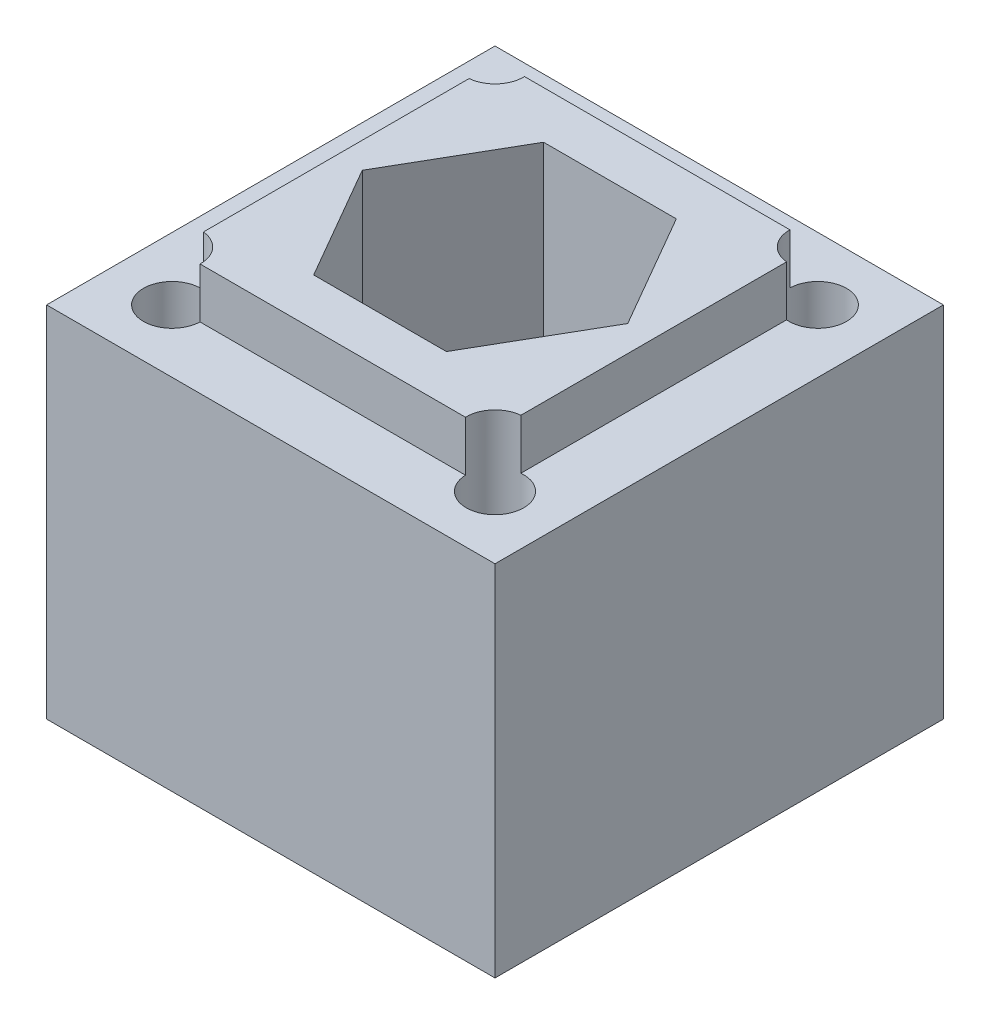
ISO-10303-21;
HEADER;
FILE_DESCRIPTION(('STEP AP214'),'2;1');
FILE_NAME('part.step','',(''),(''),'','','');
FILE_SCHEMA(('AUTOMOTIVE_DESIGN { 1 0 10303 214 1 1 1 1 }'));
ENDSEC;
DATA;
#1=APPLICATION_CONTEXT('core data for automotive mechanical design processes');
#2=APPLICATION_PROTOCOL_DEFINITION('international standard','automotive_design',2000,#1);
#3=PRODUCT_CONTEXT('',#1,'mechanical');
#4=PRODUCT('Part','Part','',(#3));
#5=PRODUCT_RELATED_PRODUCT_CATEGORY('part','',(#4));
#6=PRODUCT_DEFINITION_FORMATION('','',#4);
#7=PRODUCT_DEFINITION_CONTEXT('part definition',#1,'design');
#8=PRODUCT_DEFINITION('design','',#6,#7);
#9=PRODUCT_DEFINITION_SHAPE('','',#8);
#10=(LENGTH_UNIT() NAMED_UNIT(*) SI_UNIT(.MILLI.,.METRE.));
#11=(NAMED_UNIT(*) PLANE_ANGLE_UNIT() SI_UNIT($,.RADIAN.));
#12=(NAMED_UNIT(*) SI_UNIT($,.STERADIAN.) SOLID_ANGLE_UNIT());
#13=UNCERTAINTY_MEASURE_WITH_UNIT(LENGTH_MEASURE(1.E-05),#10,'distance_accuracy_value','');
#14=(GEOMETRIC_REPRESENTATION_CONTEXT(3) GLOBAL_UNCERTAINTY_ASSIGNED_CONTEXT((#13)) GLOBAL_UNIT_ASSIGNED_CONTEXT((#10,
#11,#12)) REPRESENTATION_CONTEXT('',''));
#15=CARTESIAN_POINT('',(0.,0.,0.));
#16=DIRECTION('',(0.,0.,1.));
#17=DIRECTION('',(1.,0.,0.));
#18=AXIS2_PLACEMENT_3D('',#15,#16,#17);
#19=CARTESIAN_POINT('',(0.,20.,0.));
#20=DIRECTION('',(0.,1.,0.));
#21=DIRECTION('',(0.,0.,1.));
#22=AXIS2_PLACEMENT_3D('',#19,#20,#21);
#23=PLANE('',#22);
#24=CARTESIAN_POINT('',(-9.,20.,9.));
#25=DIRECTION('',(0.,1.,0.));
#26=DIRECTION('',(0.,0.,1.));
#27=AXIS2_PLACEMENT_3D('',#24,#25,#26);
#28=CIRCLE('',#27,1.6);
#29=CARTESIAN_POINT('',(-8.84999999999999,20.,7.4070467677926));
#30=VERTEX_POINT('',#29);
#31=CARTESIAN_POINT('',(-7.40067118298047,20.,9.04633934668198));
#32=VERTEX_POINT('',#31);
#33=EDGE_CURVE('E50',#30,#32,#28,.T.);
#34=ORIENTED_EDGE('',*,*,#33,.F.);
#35=DIRECTION('',(0.,0.,1.));
#36=VECTOR('',#35,1.);
#37=CARTESIAN_POINT('',(-8.85,20.,-9.04633934668197));
#38=LINE('',#37,#36);
#39=CARTESIAN_POINT('',(-8.85,20.,-7.4070467677926));
#40=VERTEX_POINT('',#39);
#41=EDGE_CURVE('E193',#40,#30,#38,.T.);
#42=ORIENTED_EDGE('',*,*,#41,.F.);
#43=CARTESIAN_POINT('',(-9.,20.,-9.));
#44=DIRECTION('',(0.,1.,0.));
#45=DIRECTION('',(0.,0.,1.));
#46=AXIS2_PLACEMENT_3D('',#43,#44,#45);
#47=CIRCLE('',#46,1.6);
#48=CARTESIAN_POINT('',(-7.40067118298047,20.,-9.04633934668197));
#49=VERTEX_POINT('',#48);
#50=EDGE_CURVE('E282',#49,#40,#47,.T.);
#51=ORIENTED_EDGE('',*,*,#50,.F.);
#52=DIRECTION('',(-1.,0.,0.));
#53=VECTOR('',#52,1.);
#54=CARTESIAN_POINT('',(8.85,20.,-9.04633934668198));
#55=LINE('',#54,#53);
#56=CARTESIAN_POINT('',(7.40067118298047,20.,-9.04633934668198));
#57=VERTEX_POINT('',#56);
#58=EDGE_CURVE('E202',#57,#49,#55,.T.);
#59=ORIENTED_EDGE('',*,*,#58,.F.);
#60=CARTESIAN_POINT('',(9.,20.,-9.));
#61=DIRECTION('',(0.,1.,0.));
#62=DIRECTION('',(0.,0.,1.));
#63=AXIS2_PLACEMENT_3D('',#60,#61,#62);
#64=CIRCLE('',#63,1.6);
#65=CARTESIAN_POINT('',(8.85,20.,-7.4070467677926));
#66=VERTEX_POINT('',#65);
#67=EDGE_CURVE('E164',#66,#57,#64,.T.);
#68=ORIENTED_EDGE('',*,*,#67,.F.);
#69=DIRECTION('',(0.,0.,-1.));
#70=VECTOR('',#69,1.);
#71=CARTESIAN_POINT('',(8.85,20.,-9.04633934668198));
#72=LINE('',#71,#70);
#73=CARTESIAN_POINT('',(8.85,20.,7.40704676779259));
#74=VERTEX_POINT('',#73);
#75=EDGE_CURVE('E199',#74,#66,#72,.T.);
#76=ORIENTED_EDGE('',*,*,#75,.F.);
#77=CARTESIAN_POINT('',(9.,20.,9.));
#78=DIRECTION('',(0.,1.,0.));
#79=DIRECTION('',(0.,0.,1.));
#80=AXIS2_PLACEMENT_3D('',#77,#78,#79);
#81=CIRCLE('',#80,1.6);
#82=CARTESIAN_POINT('',(7.40067118298047,20.,9.04633934668198));
#83=VERTEX_POINT('',#82);
#84=EDGE_CURVE('E277',#83,#74,#81,.T.);
#85=ORIENTED_EDGE('',*,*,#84,.F.);
#86=DIRECTION('',(1.,0.,0.));
#87=VECTOR('',#86,1.);
#88=CARTESIAN_POINT('',(8.85,20.,9.04633934668198));
#89=LINE('',#88,#87);
#90=EDGE_CURVE('E196',#32,#83,#89,.T.);
#91=ORIENTED_EDGE('',*,*,#90,.F.);
#92=EDGE_LOOP('',(#34,#42,#51,#59,#68,#76,#85,#91));
#93=FACE_BOUND('',#92,.T.);
#94=DIRECTION('',(0.,0.,1.));
#95=VECTOR('',#94,1.);
#96=CARTESIAN_POINT('',(-12.5,20.,12.5));
#97=LINE('',#96,#95);
#98=CARTESIAN_POINT('',(-12.5,20.,-12.5));
#99=VERTEX_POINT('',#98);
#100=CARTESIAN_POINT('',(-12.5,20.,12.5));
#101=VERTEX_POINT('',#100);
#102=EDGE_CURVE('E236',#99,#101,#97,.T.);
#103=ORIENTED_EDGE('',*,*,#102,.T.);
#104=DIRECTION('',(1.,0.,0.));
#105=VECTOR('',#104,1.);
#106=CARTESIAN_POINT('',(12.5,20.,12.5));
#107=LINE('',#106,#105);
#108=CARTESIAN_POINT('',(12.5,20.,12.5));
#109=VERTEX_POINT('',#108);
#110=EDGE_CURVE('E239',#101,#109,#107,.T.);
#111=ORIENTED_EDGE('',*,*,#110,.T.);
#112=DIRECTION('',(0.,0.,-1.));
#113=VECTOR('',#112,1.);
#114=CARTESIAN_POINT('',(12.5,20.,12.5));
#115=LINE('',#114,#113);
#116=CARTESIAN_POINT('',(12.5,20.,-12.5));
#117=VERTEX_POINT('',#116);
#118=EDGE_CURVE('E242',#109,#117,#115,.T.);
#119=ORIENTED_EDGE('',*,*,#118,.T.);
#120=DIRECTION('',(-1.,0.,0.));
#121=VECTOR('',#120,1.);
#122=CARTESIAN_POINT('',(12.5,20.,-12.5));
#123=LINE('',#122,#121);
#124=EDGE_CURVE('E244',#117,#99,#123,.T.);
#125=ORIENTED_EDGE('',*,*,#124,.T.);
#126=EDGE_LOOP('',(#103,#111,#119,#125));
#127=FACE_BOUND('',#126,.T.);
#128=ADVANCED_FACE('F35',(#93,#127),#23,.T.);
#129=CARTESIAN_POINT('',(0.,0.,0.));
#130=DIRECTION('',(0.,1.,0.));
#131=DIRECTION('',(0.,0.,1.));
#132=AXIS2_PLACEMENT_3D('',#129,#130,#131);
#133=CYLINDRICAL_SURFACE('',#132,4.15);
#134=CARTESIAN_POINT('',(0.,0.,0.));
#135=DIRECTION('',(0.,1.,0.));
#136=DIRECTION('',(0.,0.,1.));
#137=AXIS2_PLACEMENT_3D('',#134,#135,#136);
#138=CIRCLE('',#137,4.15);
#139=CARTESIAN_POINT('',(0.,0.,4.15));
#140=VERTEX_POINT('',#139);
#141=EDGE_CURVE('E232',#140,#140,#138,.T.);
#142=ORIENTED_EDGE('',*,*,#141,.F.);
#143=EDGE_LOOP('',(#142));
#144=FACE_BOUND('',#143,.T.);
#145=CARTESIAN_POINT('',(0.,13.,0.));
#146=DIRECTION('',(0.,1.,0.));
#147=DIRECTION('',(0.,0.,1.));
#148=AXIS2_PLACEMENT_3D('',#145,#146,#147);
#149=CIRCLE('',#148,4.15);
#150=CARTESIAN_POINT('',(0.,13.,4.15));
#151=VERTEX_POINT('',#150);
#152=EDGE_CURVE('E222',#151,#151,#149,.F.);
#153=ORIENTED_EDGE('',*,*,#152,.F.);
#154=EDGE_LOOP('',(#153));
#155=FACE_BOUND('',#154,.T.);
#156=ADVANCED_FACE('F351',(#144,#155),#133,.F.);
#157=CARTESIAN_POINT('',(-12.5,20.,12.5));
#158=DIRECTION('',(1.,0.,0.));
#159=DIRECTION('',(0.,0.,-1.));
#160=AXIS2_PLACEMENT_3D('',#157,#158,#159);
#161=PLANE('',#160);
#162=DIRECTION('',(0.,0.,1.));
#163=VECTOR('',#162,1.);
#164=CARTESIAN_POINT('',(-12.5,0.,12.5));
#165=LINE('',#164,#163);
#166=CARTESIAN_POINT('',(-12.5,0.,-12.5));
#167=VERTEX_POINT('',#166);
#168=CARTESIAN_POINT('',(-12.5,0.,12.5));
#169=VERTEX_POINT('',#168);
#170=EDGE_CURVE('E235',#167,#169,#165,.T.);
#171=ORIENTED_EDGE('',*,*,#170,.T.);
#172=DIRECTION('',(0.,-1.,0.));
#173=VECTOR('',#172,1.);
#174=CARTESIAN_POINT('',(-12.5,20.,12.5));
#175=LINE('',#174,#173);
#176=EDGE_CURVE('E262',#101,#169,#175,.T.);
#177=ORIENTED_EDGE('',*,*,#176,.F.);
#178=ORIENTED_EDGE('',*,*,#102,.F.);
#179=DIRECTION('',(0.,-1.,0.));
#180=VECTOR('',#179,1.);
#181=CARTESIAN_POINT('',(-12.5,20.,-12.5));
#182=LINE('',#181,#180);
#183=EDGE_CURVE('E246',#99,#167,#182,.T.);
#184=ORIENTED_EDGE('',*,*,#183,.T.);
#185=EDGE_LOOP('',(#171,#177,#178,#184));
#186=FACE_BOUND('',#185,.T.);
#187=ADVANCED_FACE('F37',(#186),#161,.F.);
#188=CARTESIAN_POINT('',(12.5,20.,12.5));
#189=DIRECTION('',(0.,0.,-1.));
#190=DIRECTION('',(-1.,0.,0.));
#191=AXIS2_PLACEMENT_3D('',#188,#189,#190);
#192=PLANE('',#191);
#193=DIRECTION('',(1.,0.,0.));
#194=VECTOR('',#193,1.);
#195=CARTESIAN_POINT('',(12.5,0.,12.5));
#196=LINE('',#195,#194);
#197=CARTESIAN_POINT('',(12.5,0.,12.5));
#198=VERTEX_POINT('',#197);
#199=EDGE_CURVE('E249',#169,#198,#196,.T.);
#200=ORIENTED_EDGE('',*,*,#199,.T.);
#201=DIRECTION('',(0.,-1.,0.));
#202=VECTOR('',#201,1.);
#203=CARTESIAN_POINT('',(12.5,20.,12.5));
#204=LINE('',#203,#202);
#205=EDGE_CURVE('E259',#109,#198,#204,.T.);
#206=ORIENTED_EDGE('',*,*,#205,.F.);
#207=ORIENTED_EDGE('',*,*,#110,.F.);
#208=ORIENTED_EDGE('',*,*,#176,.T.);
#209=EDGE_LOOP('',(#200,#206,#207,#208));
#210=FACE_BOUND('',#209,.T.);
#211=ADVANCED_FACE('F371',(#210),#192,.F.);
#212=CARTESIAN_POINT('',(12.5,20.,12.5));
#213=DIRECTION('',(-1.,0.,0.));
#214=DIRECTION('',(0.,0.,1.));
#215=AXIS2_PLACEMENT_3D('',#212,#213,#214);
#216=PLANE('',#215);
#217=DIRECTION('',(0.,0.,-1.));
#218=VECTOR('',#217,1.);
#219=CARTESIAN_POINT('',(12.5,0.,12.5));
#220=LINE('',#219,#218);
#221=CARTESIAN_POINT('',(12.5,0.,-12.5));
#222=VERTEX_POINT('',#221);
#223=EDGE_CURVE('E251',#198,#222,#220,.T.);
#224=ORIENTED_EDGE('',*,*,#223,.T.);
#225=DIRECTION('',(0.,-1.,0.));
#226=VECTOR('',#225,1.);
#227=CARTESIAN_POINT('',(12.5,20.,-12.5));
#228=LINE('',#227,#226);
#229=EDGE_CURVE('E256',#117,#222,#228,.T.);
#230=ORIENTED_EDGE('',*,*,#229,.F.);
#231=ORIENTED_EDGE('',*,*,#118,.F.);
#232=ORIENTED_EDGE('',*,*,#205,.T.);
#233=EDGE_LOOP('',(#224,#230,#231,#232));
#234=FACE_BOUND('',#233,.T.);
#235=ADVANCED_FACE('F368',(#234),#216,.F.);
#236=CARTESIAN_POINT('',(12.5,20.,-12.5));
#237=DIRECTION('',(0.,0.,1.));
#238=DIRECTION('',(1.,0.,0.));
#239=AXIS2_PLACEMENT_3D('',#236,#237,#238);
#240=PLANE('',#239);
#241=DIRECTION('',(-1.,0.,0.));
#242=VECTOR('',#241,1.);
#243=CARTESIAN_POINT('',(12.5,0.,-12.5));
#244=LINE('',#243,#242);
#245=EDGE_CURVE('E240',#222,#167,#244,.T.);
#246=ORIENTED_EDGE('',*,*,#245,.T.);
#247=ORIENTED_EDGE('',*,*,#183,.F.);
#248=ORIENTED_EDGE('',*,*,#124,.F.);
#249=ORIENTED_EDGE('',*,*,#229,.T.);
#250=EDGE_LOOP('',(#246,#247,#248,#249));
#251=FACE_BOUND('',#250,.T.);
#252=ADVANCED_FACE('F364',(#251),#240,.F.);
#253=CARTESIAN_POINT('',(0.,0.,0.));
#254=DIRECTION('',(0.,1.,0.));
#255=DIRECTION('',(0.,0.,1.));
#256=AXIS2_PLACEMENT_3D('',#253,#254,#255);
#257=PLANE('',#256);
#258=CARTESIAN_POINT('',(-9.,0.,9.));
#259=DIRECTION('',(0.,1.,0.));
#260=DIRECTION('',(0.,0.,1.));
#261=AXIS2_PLACEMENT_3D('',#258,#259,#260);
#262=CIRCLE('',#261,1.6);
#263=CARTESIAN_POINT('',(-9.,0.,10.6));
#264=VERTEX_POINT('',#263);
#265=EDGE_CURVE('E280',#264,#264,#262,.T.);
#266=ORIENTED_EDGE('',*,*,#265,.T.);
#267=EDGE_LOOP('',(#266));
#268=FACE_BOUND('',#267,.T.);
#269=CARTESIAN_POINT('',(-9.,0.,-9.));
#270=DIRECTION('',(0.,1.,0.));
#271=DIRECTION('',(0.,0.,1.));
#272=AXIS2_PLACEMENT_3D('',#269,#270,#271);
#273=CIRCLE('',#272,1.6);
#274=CARTESIAN_POINT('',(-9.,0.,-7.4));
#275=VERTEX_POINT('',#274);
#276=EDGE_CURVE('E334',#275,#275,#273,.T.);
#277=ORIENTED_EDGE('',*,*,#276,.T.);
#278=EDGE_LOOP('',(#277));
#279=FACE_BOUND('',#278,.T.);
#280=CARTESIAN_POINT('',(9.,0.,-9.));
#281=DIRECTION('',(0.,1.,0.));
#282=DIRECTION('',(0.,0.,1.));
#283=AXIS2_PLACEMENT_3D('',#280,#281,#282);
#284=CIRCLE('',#283,1.6);
#285=CARTESIAN_POINT('',(9.,0.,-7.4));
#286=VERTEX_POINT('',#285);
#287=EDGE_CURVE('E181',#286,#286,#284,.T.);
#288=ORIENTED_EDGE('',*,*,#287,.T.);
#289=EDGE_LOOP('',(#288));
#290=FACE_BOUND('',#289,.T.);
#291=CARTESIAN_POINT('',(9.,0.,9.));
#292=DIRECTION('',(0.,1.,0.));
#293=DIRECTION('',(0.,0.,1.));
#294=AXIS2_PLACEMENT_3D('',#291,#292,#293);
#295=CIRCLE('',#294,1.6);
#296=CARTESIAN_POINT('',(9.,0.,10.6));
#297=VERTEX_POINT('',#296);
#298=EDGE_CURVE('E299',#297,#297,#295,.T.);
#299=ORIENTED_EDGE('',*,*,#298,.T.);
#300=EDGE_LOOP('',(#299));
#301=FACE_BOUND('',#300,.T.);
#302=ORIENTED_EDGE('',*,*,#141,.T.);
#303=EDGE_LOOP('',(#302));
#304=FACE_BOUND('',#303,.T.);
#305=ORIENTED_EDGE('',*,*,#170,.F.);
#306=ORIENTED_EDGE('',*,*,#245,.F.);
#307=ORIENTED_EDGE('',*,*,#223,.F.);
#308=ORIENTED_EDGE('',*,*,#199,.F.);
#309=EDGE_LOOP('',(#305,#306,#307,#308));
#310=FACE_BOUND('',#309,.T.);
#311=ADVANCED_FACE('F360',(#268,#279,#290,#301,#304,#310),#257,.F.);
#312=CARTESIAN_POINT('',(0.,13.,0.));
#313=DIRECTION('',(0.,1.,0.));
#314=DIRECTION('',(0.,0.,1.));
#315=AXIS2_PLACEMENT_3D('',#312,#313,#314);
#316=PLANE('',#315);
#317=DIRECTION('',(0.5,0.,0.866025403784439));
#318=VECTOR('',#317,1.);
#319=CARTESIAN_POINT('',(-7.4,13.,0.));
#320=LINE('',#319,#318);
#321=CARTESIAN_POINT('',(-7.4,13.,0.));
#322=VERTEX_POINT('',#321);
#323=CARTESIAN_POINT('',(-3.7,13.,6.40858798800485));
#324=VERTEX_POINT('',#323);
#325=EDGE_CURVE('E184',#322,#324,#320,.T.);
#326=ORIENTED_EDGE('',*,*,#325,.T.);
#327=DIRECTION('',(1.,0.,0.));
#328=VECTOR('',#327,1.);
#329=CARTESIAN_POINT('',(-3.7,13.,6.40858798800485));
#330=LINE('',#329,#328);
#331=CARTESIAN_POINT('',(3.7,13.,6.40858798800485));
#332=VERTEX_POINT('',#331);
#333=EDGE_CURVE('E187',#324,#332,#330,.T.);
#334=ORIENTED_EDGE('',*,*,#333,.T.);
#335=DIRECTION('',(0.5,0.,-0.866025403784439));
#336=VECTOR('',#335,1.);
#337=CARTESIAN_POINT('',(3.7,13.,6.40858798800485));
#338=LINE('',#337,#336);
#339=CARTESIAN_POINT('',(7.4,13.,0.));
#340=VERTEX_POINT('',#339);
#341=EDGE_CURVE('E207',#332,#340,#338,.T.);
#342=ORIENTED_EDGE('',*,*,#341,.T.);
#343=DIRECTION('',(-0.5,0.,-0.866025403784439));
#344=VECTOR('',#343,1.);
#345=CARTESIAN_POINT('',(7.4,13.,0.));
#346=LINE('',#345,#344);
#347=CARTESIAN_POINT('',(3.7,13.,-6.40858798800485));
#348=VERTEX_POINT('',#347);
#349=EDGE_CURVE('E210',#340,#348,#346,.T.);
#350=ORIENTED_EDGE('',*,*,#349,.T.);
#351=DIRECTION('',(-1.,0.,0.));
#352=VECTOR('',#351,1.);
#353=CARTESIAN_POINT('',(3.7,13.,-6.40858798800485));
#354=LINE('',#353,#352);
#355=CARTESIAN_POINT('',(-3.7,13.,-6.40858798800484));
#356=VERTEX_POINT('',#355);
#357=EDGE_CURVE('E213',#348,#356,#354,.T.);
#358=ORIENTED_EDGE('',*,*,#357,.T.);
#359=DIRECTION('',(-0.5,0.,0.866025403784439));
#360=VECTOR('',#359,1.);
#361=CARTESIAN_POINT('',(-3.7,13.,-6.40858798800484));
#362=LINE('',#361,#360);
#363=EDGE_CURVE('E216',#356,#322,#362,.T.);
#364=ORIENTED_EDGE('',*,*,#363,.T.);
#365=EDGE_LOOP('',(#326,#334,#342,#350,#358,#364));
#366=FACE_BOUND('',#365,.T.);
#367=ORIENTED_EDGE('',*,*,#152,.T.);
#368=EDGE_LOOP('',(#367));
#369=FACE_BOUND('',#368,.T.);
#370=ADVANCED_FACE('F363',(#366,#369),#316,.T.);
#371=CARTESIAN_POINT('',(-7.4,13.,0.));
#372=DIRECTION('',(-0.866025403784438,0.,0.5));
#373=DIRECTION('',(0.5,0.,0.866025403784439));
#374=AXIS2_PLACEMENT_3D('',#371,#372,#373);
#375=PLANE('',#374);
#376=DIRECTION('',(0.,1.,0.));
#377=VECTOR('',#376,1.);
#378=CARTESIAN_POINT('',(-7.4,13.,0.));
#379=LINE('',#378,#377);
#380=CARTESIAN_POINT('',(-7.4,22.8,0.));
#381=VERTEX_POINT('',#380);
#382=EDGE_CURVE('E220',#322,#381,#379,.T.);
#383=ORIENTED_EDGE('',*,*,#382,.T.);
#384=DIRECTION('',(0.500000000000005,0.,0.866025403784436));
#385=VECTOR('',#384,1.);
#386=CARTESIAN_POINT('',(-7.4,22.8,0.));
#387=LINE('',#386,#385);
#388=CARTESIAN_POINT('',(-3.7,22.8,6.40858798800485));
#389=VERTEX_POINT('',#388);
#390=EDGE_CURVE('E306',#381,#389,#387,.T.);
#391=ORIENTED_EDGE('',*,*,#390,.T.);
#392=DIRECTION('',(0.,1.,0.));
#393=VECTOR('',#392,1.);
#394=CARTESIAN_POINT('',(-3.7,13.,6.40858798800485));
#395=LINE('',#394,#393);
#396=EDGE_CURVE('E219',#324,#389,#395,.T.);
#397=ORIENTED_EDGE('',*,*,#396,.F.);
#398=ORIENTED_EDGE('',*,*,#325,.F.);
#399=EDGE_LOOP('',(#383,#391,#397,#398));
#400=FACE_BOUND('',#399,.T.);
#401=ADVANCED_FACE('F410',(#400),#375,.F.);
#402=CARTESIAN_POINT('',(-3.7,13.,-6.40858798800484));
#403=DIRECTION('',(-0.866025403784439,0.,-0.5));
#404=DIRECTION('',(-0.5,0.,0.866025403784439));
#405=AXIS2_PLACEMENT_3D('',#402,#403,#404);
#406=PLANE('',#405);
#407=DIRECTION('',(0.,1.,0.));
#408=VECTOR('',#407,1.);
#409=CARTESIAN_POINT('',(-3.7,13.,-6.40858798800484));
#410=LINE('',#409,#408);
#411=CARTESIAN_POINT('',(-3.70000000000005,22.8,-6.4085879880048));
#412=VERTEX_POINT('',#411);
#413=EDGE_CURVE('E223',#356,#412,#410,.T.);
#414=ORIENTED_EDGE('',*,*,#413,.T.);
#415=DIRECTION('',(-0.499999999999991,0.,0.866025403784444));
#416=VECTOR('',#415,1.);
#417=CARTESIAN_POINT('',(-3.70000000000005,22.8,-6.4085879880048));
#418=LINE('',#417,#416);
#419=EDGE_CURVE('E197',#412,#381,#418,.T.);
#420=ORIENTED_EDGE('',*,*,#419,.T.);
#421=ORIENTED_EDGE('',*,*,#382,.F.);
#422=ORIENTED_EDGE('',*,*,#363,.F.);
#423=EDGE_LOOP('',(#414,#420,#421,#422));
#424=FACE_BOUND('',#423,.T.);
#425=ADVANCED_FACE('F421',(#424),#406,.F.);
#426=CARTESIAN_POINT('',(3.7,13.,-6.40858798800485));
#427=DIRECTION('',(0.,0.,-1.));
#428=DIRECTION('',(-1.,0.,0.));
#429=AXIS2_PLACEMENT_3D('',#426,#427,#428);
#430=PLANE('',#429);
#431=DIRECTION('',(0.,1.,0.));
#432=VECTOR('',#431,1.);
#433=CARTESIAN_POINT('',(3.7,13.,-6.40858798800485));
#434=LINE('',#433,#432);
#435=CARTESIAN_POINT('',(3.69999999999996,22.8,-6.40858798800486));
#436=VERTEX_POINT('',#435);
#437=EDGE_CURVE('E225',#348,#436,#434,.T.);
#438=ORIENTED_EDGE('',*,*,#437,.T.);
#439=DIRECTION('',(-1.,0.,0.));
#440=VECTOR('',#439,1.);
#441=CARTESIAN_POINT('',(3.69999999999996,22.8,-6.40858798800486));
#442=LINE('',#441,#440);
#443=EDGE_CURVE('E318',#436,#412,#442,.T.);
#444=ORIENTED_EDGE('',*,*,#443,.T.);
#445=ORIENTED_EDGE('',*,*,#413,.F.);
#446=ORIENTED_EDGE('',*,*,#357,.F.);
#447=EDGE_LOOP('',(#438,#444,#445,#446));
#448=FACE_BOUND('',#447,.T.);
#449=ADVANCED_FACE('F431',(#448),#430,.F.);
#450=CARTESIAN_POINT('',(7.4,13.,0.));
#451=DIRECTION('',(0.866025403784438,0.,-0.5));
#452=DIRECTION('',(-0.5,0.,-0.866025403784439));
#453=AXIS2_PLACEMENT_3D('',#450,#451,#452);
#454=PLANE('',#453);
#455=DIRECTION('',(0.,1.,0.));
#456=VECTOR('',#455,1.);
#457=CARTESIAN_POINT('',(7.4,13.,0.));
#458=LINE('',#457,#456);
#459=CARTESIAN_POINT('',(7.4,22.8,0.));
#460=VERTEX_POINT('',#459);
#461=EDGE_CURVE('E227',#340,#460,#458,.T.);
#462=ORIENTED_EDGE('',*,*,#461,.T.);
#463=DIRECTION('',(-0.500000000000005,0.,-0.866025403784436));
#464=VECTOR('',#463,1.);
#465=CARTESIAN_POINT('',(7.4,22.8,0.));
#466=LINE('',#465,#464);
#467=EDGE_CURVE('E315',#460,#436,#466,.T.);
#468=ORIENTED_EDGE('',*,*,#467,.T.);
#469=ORIENTED_EDGE('',*,*,#437,.F.);
#470=ORIENTED_EDGE('',*,*,#349,.F.);
#471=EDGE_LOOP('',(#462,#468,#469,#470));
#472=FACE_BOUND('',#471,.T.);
#473=ADVANCED_FACE('F442',(#472),#454,.F.);
#474=CARTESIAN_POINT('',(3.7,13.,6.40858798800485));
#475=DIRECTION('',(0.866025403784439,0.,0.5));
#476=DIRECTION('',(0.5,0.,-0.866025403784439));
#477=AXIS2_PLACEMENT_3D('',#474,#475,#476);
#478=PLANE('',#477);
#479=DIRECTION('',(0.,1.,0.));
#480=VECTOR('',#479,1.);
#481=CARTESIAN_POINT('',(3.7,13.,6.40858798800485));
#482=LINE('',#481,#480);
#483=CARTESIAN_POINT('',(3.70000000000001,22.8,6.40858798800484));
#484=VERTEX_POINT('',#483);
#485=EDGE_CURVE('E229',#332,#484,#482,.T.);
#486=ORIENTED_EDGE('',*,*,#485,.T.);
#487=DIRECTION('',(0.499999999999997,0.,-0.86602540378444));
#488=VECTOR('',#487,1.);
#489=CARTESIAN_POINT('',(3.70000000000001,22.8,6.40858798800484));
#490=LINE('',#489,#488);
#491=EDGE_CURVE('E312',#484,#460,#490,.T.);
#492=ORIENTED_EDGE('',*,*,#491,.T.);
#493=ORIENTED_EDGE('',*,*,#461,.F.);
#494=ORIENTED_EDGE('',*,*,#341,.F.);
#495=EDGE_LOOP('',(#486,#492,#493,#494));
#496=FACE_BOUND('',#495,.T.);
#497=ADVANCED_FACE('F453',(#496),#478,.F.);
#498=CARTESIAN_POINT('',(-3.7,13.,6.40858798800485));
#499=DIRECTION('',(0.,0.,1.));
#500=DIRECTION('',(1.,0.,0.));
#501=AXIS2_PLACEMENT_3D('',#498,#499,#500);
#502=PLANE('',#501);
#503=ORIENTED_EDGE('',*,*,#396,.T.);
#504=DIRECTION('',(1.,0.,0.));
#505=VECTOR('',#504,1.);
#506=CARTESIAN_POINT('',(-3.7,22.8,6.40858798800485));
#507=LINE('',#506,#505);
#508=EDGE_CURVE('E309',#389,#484,#507,.T.);
#509=ORIENTED_EDGE('',*,*,#508,.T.);
#510=ORIENTED_EDGE('',*,*,#485,.F.);
#511=ORIENTED_EDGE('',*,*,#333,.F.);
#512=EDGE_LOOP('',(#503,#509,#510,#511));
#513=FACE_BOUND('',#512,.T.);
#514=ADVANCED_FACE('F464',(#513),#502,.F.);
#515=CARTESIAN_POINT('',(0.,22.8,0.));
#516=DIRECTION('',(0.,-1.,0.));
#517=DIRECTION('',(0.,0.,-1.));
#518=AXIS2_PLACEMENT_3D('',#515,#516,#517);
#519=PLANE('',#518);
#520=DIRECTION('',(0.,0.,1.));
#521=VECTOR('',#520,1.);
#522=CARTESIAN_POINT('',(-8.85,22.8,-9.04633934668197));
#523=LINE('',#522,#521);
#524=CARTESIAN_POINT('',(-8.85,22.8,-7.4070467677926));
#525=VERTEX_POINT('',#524);
#526=CARTESIAN_POINT('',(-8.84999999999999,22.8,7.4070467677926));
#527=VERTEX_POINT('',#526);
#528=EDGE_CURVE('E203',#525,#527,#523,.T.);
#529=ORIENTED_EDGE('',*,*,#528,.T.);
#530=CARTESIAN_POINT('',(-9.,22.8,9.));
#531=DIRECTION('',(0.,1.,0.));
#532=DIRECTION('',(0.,0.,1.));
#533=AXIS2_PLACEMENT_3D('',#530,#531,#532);
#534=CIRCLE('',#533,1.6);
#535=CARTESIAN_POINT('',(-7.40067118298047,22.8,9.04633934668198));
#536=VERTEX_POINT('',#535);
#537=EDGE_CURVE('E285',#536,#527,#534,.T.);
#538=ORIENTED_EDGE('',*,*,#537,.F.);
#539=DIRECTION('',(1.,0.,0.));
#540=VECTOR('',#539,1.);
#541=CARTESIAN_POINT('',(8.85,22.8,9.04633934668198));
#542=LINE('',#541,#540);
#543=CARTESIAN_POINT('',(7.40067118298047,22.8,9.04633934668198));
#544=VERTEX_POINT('',#543);
#545=EDGE_CURVE('E189',#536,#544,#542,.T.);
#546=ORIENTED_EDGE('',*,*,#545,.T.);
#547=CARTESIAN_POINT('',(9.,22.8,9.));
#548=DIRECTION('',(0.,1.,0.));
#549=DIRECTION('',(0.,0.,1.));
#550=AXIS2_PLACEMENT_3D('',#547,#548,#549);
#551=CIRCLE('',#550,1.6);
#552=CARTESIAN_POINT('',(8.85,22.8,7.4070467677926));
#553=VERTEX_POINT('',#552);
#554=EDGE_CURVE('E297',#553,#544,#551,.T.);
#555=ORIENTED_EDGE('',*,*,#554,.F.);
#556=DIRECTION('',(0.,0.,-1.));
#557=VECTOR('',#556,1.);
#558=CARTESIAN_POINT('',(8.85,22.8,-9.04633934668198));
#559=LINE('',#558,#557);
#560=CARTESIAN_POINT('',(8.85,22.8,-7.4070467677926));
#561=VERTEX_POINT('',#560);
#562=EDGE_CURVE('E180',#553,#561,#559,.T.);
#563=ORIENTED_EDGE('',*,*,#562,.T.);
#564=CARTESIAN_POINT('',(9.,22.8,-9.));
#565=DIRECTION('',(0.,1.,0.));
#566=DIRECTION('',(0.,0.,1.));
#567=AXIS2_PLACEMENT_3D('',#564,#565,#566);
#568=CIRCLE('',#567,1.6);
#569=CARTESIAN_POINT('',(7.40067118298047,22.8,-9.04633934668198));
#570=VERTEX_POINT('',#569);
#571=EDGE_CURVE('E161',#570,#561,#568,.T.);
#572=ORIENTED_EDGE('',*,*,#571,.F.);
#573=DIRECTION('',(-1.,0.,0.));
#574=VECTOR('',#573,1.);
#575=CARTESIAN_POINT('',(8.85,22.8,-9.04633934668198));
#576=LINE('',#575,#574);
#577=CARTESIAN_POINT('',(-7.40067118298047,22.8,-9.04633934668197));
#578=VERTEX_POINT('',#577);
#579=EDGE_CURVE('E177',#570,#578,#576,.T.);
#580=ORIENTED_EDGE('',*,*,#579,.T.);
#581=CARTESIAN_POINT('',(-9.,22.8,-9.));
#582=DIRECTION('',(0.,1.,0.));
#583=DIRECTION('',(0.,0.,1.));
#584=AXIS2_PLACEMENT_3D('',#581,#582,#583);
#585=CIRCLE('',#584,1.6);
#586=EDGE_CURVE('E57',#525,#578,#585,.T.);
#587=ORIENTED_EDGE('',*,*,#586,.F.);
#588=EDGE_LOOP('',(#529,#538,#546,#555,#563,#572,#580,#587));
#589=FACE_BOUND('',#588,.T.);
#590=ORIENTED_EDGE('',*,*,#390,.F.);
#591=ORIENTED_EDGE('',*,*,#419,.F.);
#592=ORIENTED_EDGE('',*,*,#443,.F.);
#593=ORIENTED_EDGE('',*,*,#467,.F.);
#594=ORIENTED_EDGE('',*,*,#491,.F.);
#595=ORIENTED_EDGE('',*,*,#508,.F.);
#596=EDGE_LOOP('',(#590,#591,#592,#593,#594,#595));
#597=FACE_BOUND('',#596,.T.);
#598=ADVANCED_FACE('F175',(#589,#597),#519,.F.);
#599=CARTESIAN_POINT('',(-8.85,22.8,-9.04633934668197));
#600=DIRECTION('',(1.,0.,0.));
#601=DIRECTION('',(0.,0.,-1.));
#602=AXIS2_PLACEMENT_3D('',#599,#600,#601);
#603=PLANE('',#602);
#604=ORIENTED_EDGE('',*,*,#41,.T.);
#605=DIRECTION('',(0.,1.,0.));
#606=VECTOR('',#605,1.);
#607=CARTESIAN_POINT('',(-8.84999999999999,0.,7.4070467677926));
#608=LINE('',#607,#606);
#609=EDGE_CURVE('E294',#30,#527,#608,.T.);
#610=ORIENTED_EDGE('',*,*,#609,.T.);
#611=ORIENTED_EDGE('',*,*,#528,.F.);
#612=DIRECTION('',(0.,1.,0.));
#613=VECTOR('',#612,1.);
#614=CARTESIAN_POINT('',(-8.85,0.,-7.4070467677926));
#615=LINE('',#614,#613);
#616=EDGE_CURVE('E290',#525,#40,#615,.F.);
#617=ORIENTED_EDGE('',*,*,#616,.T.);
#618=EDGE_LOOP('',(#604,#610,#611,#617));
#619=FACE_BOUND('',#618,.T.);
#620=ADVANCED_FACE('F331',(#619),#603,.F.);
#621=CARTESIAN_POINT('',(8.85,22.8,9.04633934668198));
#622=DIRECTION('',(0.,0.,-1.));
#623=DIRECTION('',(-1.,0.,0.));
#624=AXIS2_PLACEMENT_3D('',#621,#622,#623);
#625=PLANE('',#624);
#626=ORIENTED_EDGE('',*,*,#545,.F.);
#627=DIRECTION('',(0.,1.,0.));
#628=VECTOR('',#627,1.);
#629=CARTESIAN_POINT('',(-7.40067118298047,0.,9.04633934668198));
#630=LINE('',#629,#628);
#631=EDGE_CURVE('E11',#536,#32,#630,.F.);
#632=ORIENTED_EDGE('',*,*,#631,.T.);
#633=ORIENTED_EDGE('',*,*,#90,.T.);
#634=DIRECTION('',(0.,1.,0.));
#635=VECTOR('',#634,1.);
#636=CARTESIAN_POINT('',(7.40067118298047,0.,9.04633934668198));
#637=LINE('',#636,#635);
#638=EDGE_CURVE('E303',#83,#544,#637,.T.);
#639=ORIENTED_EDGE('',*,*,#638,.T.);
#640=EDGE_LOOP('',(#626,#632,#633,#639));
#641=FACE_BOUND('',#640,.T.);
#642=ADVANCED_FACE('F328',(#641),#625,.F.);
#643=CARTESIAN_POINT('',(8.85,22.8,-9.04633934668198));
#644=DIRECTION('',(-1.,0.,0.));
#645=DIRECTION('',(0.,0.,1.));
#646=AXIS2_PLACEMENT_3D('',#643,#644,#645);
#647=PLANE('',#646);
#648=ORIENTED_EDGE('',*,*,#75,.T.);
#649=DIRECTION('',(0.,1.,0.));
#650=VECTOR('',#649,1.);
#651=CARTESIAN_POINT('',(8.85,0.,-7.4070467677926));
#652=LINE('',#651,#650);
#653=EDGE_CURVE('E279',#66,#561,#652,.T.);
#654=ORIENTED_EDGE('',*,*,#653,.T.);
#655=ORIENTED_EDGE('',*,*,#562,.F.);
#656=DIRECTION('',(0.,1.,0.));
#657=VECTOR('',#656,1.);
#658=CARTESIAN_POINT('',(8.85,0.,7.4070467677926));
#659=LINE('',#658,#657);
#660=EDGE_CURVE('E169',#553,#74,#659,.F.);
#661=ORIENTED_EDGE('',*,*,#660,.T.);
#662=EDGE_LOOP('',(#648,#654,#655,#661));
#663=FACE_BOUND('',#662,.T.);
#664=ADVANCED_FACE('F270',(#663),#647,.F.);
#665=CARTESIAN_POINT('',(8.85,22.8,-9.04633934668198));
#666=DIRECTION('',(0.,0.,1.));
#667=DIRECTION('',(1.,0.,0.));
#668=AXIS2_PLACEMENT_3D('',#665,#666,#667);
#669=PLANE('',#668);
#670=ORIENTED_EDGE('',*,*,#58,.T.);
#671=DIRECTION('',(0.,1.,0.));
#672=VECTOR('',#671,1.);
#673=CARTESIAN_POINT('',(-7.40067118298047,0.,-9.04633934668197));
#674=LINE('',#673,#672);
#675=EDGE_CURVE('E43',#49,#578,#674,.T.);
#676=ORIENTED_EDGE('',*,*,#675,.T.);
#677=ORIENTED_EDGE('',*,*,#579,.F.);
#678=DIRECTION('',(0.,1.,0.));
#679=VECTOR('',#678,1.);
#680=CARTESIAN_POINT('',(7.40067118298047,0.,-9.04633934668198));
#681=LINE('',#680,#679);
#682=EDGE_CURVE('E158',#570,#57,#681,.F.);
#683=ORIENTED_EDGE('',*,*,#682,.T.);
#684=EDGE_LOOP('',(#670,#676,#677,#683));
#685=FACE_BOUND('',#684,.T.);
#686=ADVANCED_FACE('F183',(#685),#669,.F.);
#687=CARTESIAN_POINT('',(9.,0.,9.));
#688=DIRECTION('',(0.,1.,0.));
#689=DIRECTION('',(0.,0.,1.));
#690=AXIS2_PLACEMENT_3D('',#687,#688,#689);
#691=CYLINDRICAL_SURFACE('',#690,1.6);
#692=ORIENTED_EDGE('',*,*,#298,.F.);
#693=EDGE_LOOP('',(#692));
#694=FACE_BOUND('',#693,.T.);
#695=ORIENTED_EDGE('',*,*,#84,.T.);
#696=ORIENTED_EDGE('',*,*,#660,.F.);
#697=ORIENTED_EDGE('',*,*,#554,.T.);
#698=ORIENTED_EDGE('',*,*,#638,.F.);
#699=EDGE_LOOP('',(#695,#696,#697,#698));
#700=FACE_BOUND('',#699,.T.);
#701=ADVANCED_FACE('F327',(#694,#700),#691,.F.);
#702=CARTESIAN_POINT('',(9.,0.,-9.));
#703=DIRECTION('',(0.,1.,0.));
#704=DIRECTION('',(0.,0.,1.));
#705=AXIS2_PLACEMENT_3D('',#702,#703,#704);
#706=CYLINDRICAL_SURFACE('',#705,1.6);
#707=ORIENTED_EDGE('',*,*,#287,.F.);
#708=EDGE_LOOP('',(#707));
#709=FACE_BOUND('',#708,.T.);
#710=ORIENTED_EDGE('',*,*,#67,.T.);
#711=ORIENTED_EDGE('',*,*,#682,.F.);
#712=ORIENTED_EDGE('',*,*,#571,.T.);
#713=ORIENTED_EDGE('',*,*,#653,.F.);
#714=EDGE_LOOP('',(#710,#711,#712,#713));
#715=FACE_BOUND('',#714,.T.);
#716=ADVANCED_FACE('F160',(#709,#715),#706,.F.);
#717=CARTESIAN_POINT('',(-9.,0.,-9.));
#718=DIRECTION('',(0.,1.,0.));
#719=DIRECTION('',(0.,0.,1.));
#720=AXIS2_PLACEMENT_3D('',#717,#718,#719);
#721=CYLINDRICAL_SURFACE('',#720,1.6);
#722=ORIENTED_EDGE('',*,*,#276,.F.);
#723=EDGE_LOOP('',(#722));
#724=FACE_BOUND('',#723,.T.);
#725=ORIENTED_EDGE('',*,*,#586,.T.);
#726=ORIENTED_EDGE('',*,*,#675,.F.);
#727=ORIENTED_EDGE('',*,*,#50,.T.);
#728=ORIENTED_EDGE('',*,*,#616,.F.);
#729=EDGE_LOOP('',(#725,#726,#727,#728));
#730=FACE_BOUND('',#729,.T.);
#731=ADVANCED_FACE('F333',(#724,#730),#721,.F.);
#732=CARTESIAN_POINT('',(-9.,0.,9.));
#733=DIRECTION('',(0.,1.,0.));
#734=DIRECTION('',(0.,0.,1.));
#735=AXIS2_PLACEMENT_3D('',#732,#733,#734);
#736=CYLINDRICAL_SURFACE('',#735,1.6);
#737=ORIENTED_EDGE('',*,*,#265,.F.);
#738=EDGE_LOOP('',(#737));
#739=FACE_BOUND('',#738,.T.);
#740=ORIENTED_EDGE('',*,*,#33,.T.);
#741=ORIENTED_EDGE('',*,*,#631,.F.);
#742=ORIENTED_EDGE('',*,*,#537,.T.);
#743=ORIENTED_EDGE('',*,*,#609,.F.);
#744=EDGE_LOOP('',(#740,#741,#742,#743));
#745=FACE_BOUND('',#744,.T.);
#746=ADVANCED_FACE('F340',(#739,#745),#736,.F.);
#747=CLOSED_SHELL('',(#128,#156,#187,#211,#235,#252,#311,#370,#401,#425,#449,#473,#497,#514,
#598,#620,#642,#664,#686,#701,#716,#731,#746));
#748=MANIFOLD_SOLID_BREP('B2',#747);
#749=ADVANCED_BREP_SHAPE_REPRESENTATION('',(#18,#748),#14);
#750=SHAPE_DEFINITION_REPRESENTATION(#9,#749);
ENDSEC;
END-ISO-10303-21;
